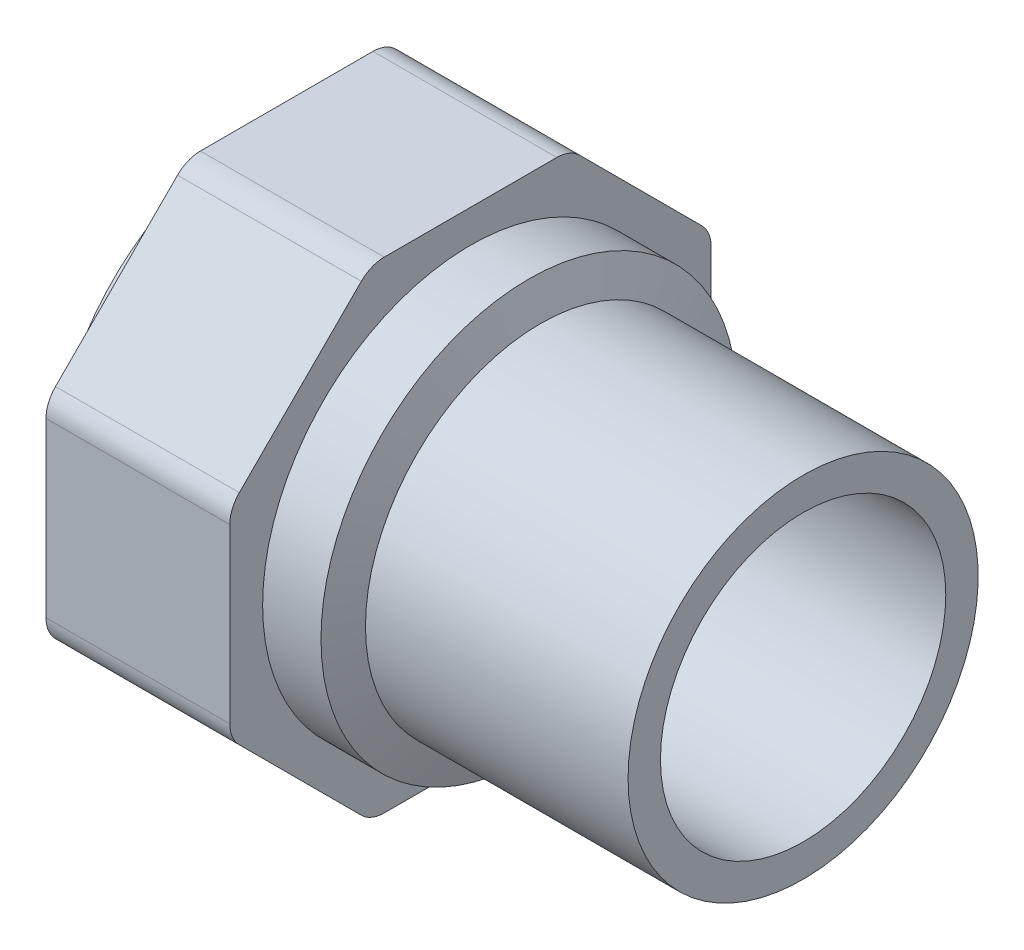
ISO-10303-21;
HEADER;
FILE_DESCRIPTION(('STEP AP214'),'2;1');
FILE_NAME('part.step','',(''),(''),'','','');
FILE_SCHEMA(('AUTOMOTIVE_DESIGN { 1 0 10303 214 1 1 1 1 }'));
ENDSEC;
DATA;
#1=APPLICATION_CONTEXT('core data for automotive mechanical design processes');
#2=APPLICATION_PROTOCOL_DEFINITION('international standard','automotive_design',2000,#1);
#3=PRODUCT_CONTEXT('',#1,'mechanical');
#4=PRODUCT('Part','Part','',(#3));
#5=PRODUCT_RELATED_PRODUCT_CATEGORY('part','',(#4));
#6=PRODUCT_DEFINITION_FORMATION('','',#4);
#7=PRODUCT_DEFINITION_CONTEXT('part definition',#1,'design');
#8=PRODUCT_DEFINITION('design','',#6,#7);
#9=PRODUCT_DEFINITION_SHAPE('','',#8);
#10=(LENGTH_UNIT() NAMED_UNIT(*) SI_UNIT(.MILLI.,.METRE.));
#11=(NAMED_UNIT(*) PLANE_ANGLE_UNIT() SI_UNIT($,.RADIAN.));
#12=(NAMED_UNIT(*) SI_UNIT($,.STERADIAN.) SOLID_ANGLE_UNIT());
#13=UNCERTAINTY_MEASURE_WITH_UNIT(LENGTH_MEASURE(1.E-05),#10,'distance_accuracy_value','');
#14=(GEOMETRIC_REPRESENTATION_CONTEXT(3) GLOBAL_UNCERTAINTY_ASSIGNED_CONTEXT((#13)) GLOBAL_UNIT_ASSIGNED_CONTEXT((#10,
#11,#12)) REPRESENTATION_CONTEXT('',''));
#15=CARTESIAN_POINT('',(0.,0.,0.));
#16=DIRECTION('',(0.,0.,1.));
#17=DIRECTION('',(1.,0.,0.));
#18=AXIS2_PLACEMENT_3D('',#15,#16,#17);
#19=CARTESIAN_POINT('',(-30.,0.,0.));
#20=DIRECTION('',(-1.,0.,0.));
#21=DIRECTION('',(0.,0.,1.));
#22=AXIS2_PLACEMENT_3D('',#19,#20,#21);
#23=CYLINDRICAL_SURFACE('',#22,20.);
#24=CARTESIAN_POINT('',(-30.,0.,0.));
#25=DIRECTION('',(1.,0.,0.));
#26=DIRECTION('',(0.,1.,0.));
#27=AXIS2_PLACEMENT_3D('',#24,#25,#26);
#28=CIRCLE('',#27,20.);
#29=CARTESIAN_POINT('',(-30.,20.,0.));
#30=VERTEX_POINT('',#29);
#31=EDGE_CURVE('E193',#30,#30,#28,.F.);
#32=ORIENTED_EDGE('',*,*,#31,.F.);
#33=EDGE_LOOP('',(#32));
#34=FACE_BOUND('',#33,.T.);
#35=CARTESIAN_POINT('',(0.,0.,0.));
#36=DIRECTION('',(-1.,0.,0.));
#37=DIRECTION('',(0.,0.,1.));
#38=AXIS2_PLACEMENT_3D('',#35,#36,#37);
#39=CIRCLE('',#38,20.);
#40=CARTESIAN_POINT('',(0.,0.,20.));
#41=VERTEX_POINT('',#40);
#42=EDGE_CURVE('E18',#41,#41,#39,.F.);
#43=ORIENTED_EDGE('',*,*,#42,.F.);
#44=EDGE_LOOP('',(#43));
#45=FACE_BOUND('',#44,.T.);
#46=ADVANCED_FACE('F15',(#34,#45),#23,.T.);
#47=CARTESIAN_POINT('',(-30.,0.,0.));
#48=DIRECTION('',(-1.,0.,0.));
#49=DIRECTION('',(0.,0.,1.));
#50=AXIS2_PLACEMENT_3D('',#47,#48,#49);
#51=CONICAL_SURFACE('',#50,20.,1.22918083614709);
#52=CARTESIAN_POINT('',(-31.3333333333333,0.,0.));
#53=DIRECTION('',(-1.,0.,0.));
#54=DIRECTION('',(0.,1.,0.));
#55=AXIS2_PLACEMENT_3D('',#52,#53,#54);
#56=CIRCLE('',#55,23.75);
#57=CARTESIAN_POINT('',(-31.3333333333333,23.75,0.));
#58=VERTEX_POINT('',#57);
#59=EDGE_CURVE('E189',#58,#58,#56,.T.);
#60=ORIENTED_EDGE('',*,*,#59,.F.);
#61=EDGE_LOOP('',(#60));
#62=FACE_BOUND('',#61,.T.);
#63=ORIENTED_EDGE('',*,*,#31,.T.);
#64=EDGE_LOOP('',(#63));
#65=FACE_BOUND('',#64,.T.);
#66=ADVANCED_FACE('F268',(#62,#65),#51,.T.);
#67=CARTESIAN_POINT('',(0.,20.,20.2400021083974));
#68=DIRECTION('',(1.,0.,0.));
#69=DIRECTION('',(0.,-1.,0.));
#70=AXIS2_PLACEMENT_3D('',#67,#68,#69);
#71=PLANE('',#70);
#72=CARTESIAN_POINT('',(0.,0.,0.));
#73=DIRECTION('',(-1.,0.,0.));
#74=DIRECTION('',(0.,0.,1.));
#75=AXIS2_PLACEMENT_3D('',#72,#73,#74);
#76=CIRCLE('',#75,16.3);
#77=CARTESIAN_POINT('',(0.,0.,16.3));
#78=VERTEX_POINT('',#77);
#79=EDGE_CURVE('E192',#78,#78,#76,.F.);
#80=ORIENTED_EDGE('',*,*,#79,.F.);
#81=EDGE_LOOP('',(#80));
#82=FACE_BOUND('',#81,.T.);
#83=ORIENTED_EDGE('',*,*,#42,.T.);
#84=EDGE_LOOP('',(#83));
#85=FACE_BOUND('',#84,.T.);
#86=ADVANCED_FACE('F264',(#82,#85),#71,.T.);
#87=CARTESIAN_POINT('',(-38.,0.,0.));
#88=DIRECTION('',(-1.,0.,0.));
#89=DIRECTION('',(0.,0.,1.));
#90=AXIS2_PLACEMENT_3D('',#87,#88,#89);
#91=CYLINDRICAL_SURFACE('',#90,23.75);
#92=CARTESIAN_POINT('',(-38.,0.,0.));
#93=DIRECTION('',(-1.,0.,0.));
#94=DIRECTION('',(0.,0.,1.));
#95=AXIS2_PLACEMENT_3D('',#92,#93,#94);
#96=CIRCLE('',#95,23.75);
#97=CARTESIAN_POINT('',(-38.,0.,23.75));
#98=VERTEX_POINT('',#97);
#99=EDGE_CURVE('E188',#98,#98,#96,.T.);
#100=ORIENTED_EDGE('',*,*,#99,.F.);
#101=EDGE_LOOP('',(#100));
#102=FACE_BOUND('',#101,.T.);
#103=ORIENTED_EDGE('',*,*,#59,.T.);
#104=EDGE_LOOP('',(#103));
#105=FACE_BOUND('',#104,.T.);
#106=ADVANCED_FACE('F267',(#102,#105),#91,.T.);
#107=CARTESIAN_POINT('',(0.,0.,0.));
#108=DIRECTION('',(-1.,0.,0.));
#109=DIRECTION('',(0.,0.,1.));
#110=AXIS2_PLACEMENT_3D('',#107,#108,#109);
#111=CYLINDRICAL_SURFACE('',#110,16.3);
#112=ORIENTED_EDGE('',*,*,#79,.T.);
#113=EDGE_LOOP('',(#112));
#114=FACE_BOUND('',#113,.T.);
#115=CARTESIAN_POINT('',(-36.8820851410869,0.,0.));
#116=DIRECTION('',(1.,0.,0.));
#117=DIRECTION('',(0.,1.,0.));
#118=AXIS2_PLACEMENT_3D('',#115,#116,#117);
#119=CIRCLE('',#118,16.3);
#120=CARTESIAN_POINT('',(-36.8820851410869,16.3,0.));
#121=VERTEX_POINT('',#120);
#122=EDGE_CURVE('E135',#121,#121,#119,.T.);
#123=ORIENTED_EDGE('',*,*,#122,.F.);
#124=EDGE_LOOP('',(#123));
#125=FACE_BOUND('',#124,.T.);
#126=ADVANCED_FACE('F261',(#114,#125),#111,.F.);
#127=CARTESIAN_POINT('',(-38.,27.5,27.5));
#128=DIRECTION('',(1.,0.,0.));
#129=DIRECTION('',(0.,-1.,0.));
#130=AXIS2_PLACEMENT_3D('',#127,#128,#129);
#131=PLANE('',#130);
#132=ORIENTED_EDGE('',*,*,#99,.T.);
#133=EDGE_LOOP('',(#132));
#134=FACE_BOUND('',#133,.T.);
#135=CARTESIAN_POINT('',(-38.,9.85828278447967,23.8));
#136=DIRECTION('',(1.,0.,0.));
#137=DIRECTION('',(0.,0.,-1.));
#138=AXIS2_PLACEMENT_3D('',#135,#136,#137);
#139=CIRCLE('',#138,3.69999999999999);
#140=CARTESIAN_POINT('',(-38.,9.85828278447966,27.5));
#141=VERTEX_POINT('',#140);
#142=CARTESIAN_POINT('',(-38.,12.4745778748699,26.4162950903902));
#143=VERTEX_POINT('',#142);
#144=EDGE_CURVE('E254',#141,#143,#139,.F.);
#145=ORIENTED_EDGE('',*,*,#144,.F.);
#146=DIRECTION('',(0.,1.,0.));
#147=VECTOR('',#146,1.);
#148=CARTESIAN_POINT('',(-38.,0.,27.5));
#149=LINE('',#148,#147);
#150=CARTESIAN_POINT('',(-38.,-9.85828278447966,27.5));
#151=VERTEX_POINT('',#150);
#152=EDGE_CURVE('E132',#151,#141,#149,.T.);
#153=ORIENTED_EDGE('',*,*,#152,.F.);
#154=CARTESIAN_POINT('',(-38.,-9.85828278447967,23.8));
#155=DIRECTION('',(1.,0.,0.));
#156=DIRECTION('',(0.,0.,-1.));
#157=AXIS2_PLACEMENT_3D('',#154,#155,#156);
#158=CIRCLE('',#157,3.69999999999997);
#159=CARTESIAN_POINT('',(-38.,-12.4745778748699,26.4162950903902));
#160=VERTEX_POINT('',#159);
#161=EDGE_CURVE('E126',#160,#151,#158,.F.);
#162=ORIENTED_EDGE('',*,*,#161,.F.);
#163=DIRECTION('',(0.,0.707106781186548,0.707106781186548));
#164=VECTOR('',#163,1.);
#165=CARTESIAN_POINT('',(-38.,-19.4454364826301,19.4454364826301));
#166=LINE('',#165,#164);
#167=CARTESIAN_POINT('',(-38.,-26.4162950903902,12.4745778748699));
#168=VERTEX_POINT('',#167);
#169=EDGE_CURVE('E130',#168,#160,#166,.T.);
#170=ORIENTED_EDGE('',*,*,#169,.F.);
#171=CARTESIAN_POINT('',(-38.,-23.8,9.85828278447966));
#172=DIRECTION('',(1.,0.,0.));
#173=DIRECTION('',(0.,0.,-1.));
#174=AXIS2_PLACEMENT_3D('',#171,#172,#173);
#175=CIRCLE('',#174,3.69999999999998);
#176=CARTESIAN_POINT('',(-38.,-27.5,9.85828278447965));
#177=VERTEX_POINT('',#176);
#178=EDGE_CURVE('E149',#177,#168,#175,.F.);
#179=ORIENTED_EDGE('',*,*,#178,.F.);
#180=DIRECTION('',(0.,0.,1.));
#181=VECTOR('',#180,1.);
#182=CARTESIAN_POINT('',(-38.,-27.5,0.));
#183=LINE('',#182,#181);
#184=CARTESIAN_POINT('',(-38.,-27.5,-9.85828278447969));
#185=VERTEX_POINT('',#184);
#186=EDGE_CURVE('E154',#185,#177,#183,.T.);
#187=ORIENTED_EDGE('',*,*,#186,.F.);
#188=CARTESIAN_POINT('',(-38.,-23.8,-9.85828278447969));
#189=DIRECTION('',(1.,0.,0.));
#190=DIRECTION('',(0.,0.,-1.));
#191=AXIS2_PLACEMENT_3D('',#188,#189,#190);
#192=CIRCLE('',#191,3.69999999999996);
#193=CARTESIAN_POINT('',(-38.,-26.4162950903902,-12.4745778748699));
#194=VERTEX_POINT('',#193);
#195=EDGE_CURVE('E239',#194,#185,#192,.F.);
#196=ORIENTED_EDGE('',*,*,#195,.F.);
#197=DIRECTION('',(0.,-0.707106781186548,0.707106781186547));
#198=VECTOR('',#197,1.);
#199=CARTESIAN_POINT('',(-38.,-19.44543648263,-19.4454364826301));
#200=LINE('',#199,#198);
#201=CARTESIAN_POINT('',(-38.,-12.4745778748699,-26.4162950903902));
#202=VERTEX_POINT('',#201);
#203=EDGE_CURVE('E159',#202,#194,#200,.T.);
#204=ORIENTED_EDGE('',*,*,#203,.F.);
#205=CARTESIAN_POINT('',(-38.,-9.85828278447965,-23.8));
#206=DIRECTION('',(1.,0.,0.));
#207=DIRECTION('',(0.,0.,-1.));
#208=AXIS2_PLACEMENT_3D('',#205,#206,#207);
#209=CIRCLE('',#208,3.70000000000001);
#210=CARTESIAN_POINT('',(-38.,-9.85828278447965,-27.5));
#211=VERTEX_POINT('',#210);
#212=EDGE_CURVE('E242',#211,#202,#209,.F.);
#213=ORIENTED_EDGE('',*,*,#212,.F.);
#214=DIRECTION('',(0.,-1.,0.));
#215=VECTOR('',#214,1.);
#216=CARTESIAN_POINT('',(-38.,0.,-27.5));
#217=LINE('',#216,#215);
#218=CARTESIAN_POINT('',(-38.,9.85828278447969,-27.5));
#219=VERTEX_POINT('',#218);
#220=EDGE_CURVE('E164',#219,#211,#217,.T.);
#221=ORIENTED_EDGE('',*,*,#220,.F.);
#222=CARTESIAN_POINT('',(-38.,9.85828278447969,-23.8));
#223=DIRECTION('',(1.,0.,0.));
#224=DIRECTION('',(0.,0.,-1.));
#225=AXIS2_PLACEMENT_3D('',#222,#223,#224);
#226=CIRCLE('',#225,3.69999999999999);
#227=CARTESIAN_POINT('',(-38.,12.4745778748699,-26.4162950903902));
#228=VERTEX_POINT('',#227);
#229=EDGE_CURVE('E245',#228,#219,#226,.F.);
#230=ORIENTED_EDGE('',*,*,#229,.F.);
#231=DIRECTION('',(0.,-0.707106781186547,-0.707106781186548));
#232=VECTOR('',#231,1.);
#233=CARTESIAN_POINT('',(-38.,19.4454364826301,-19.4454364826301));
#234=LINE('',#233,#232);
#235=CARTESIAN_POINT('',(-38.,26.4162950903902,-12.4745778748699));
#236=VERTEX_POINT('',#235);
#237=EDGE_CURVE('E169',#236,#228,#234,.T.);
#238=ORIENTED_EDGE('',*,*,#237,.F.);
#239=CARTESIAN_POINT('',(-38.,23.8,-9.85828278447965));
#240=DIRECTION('',(1.,0.,0.));
#241=DIRECTION('',(0.,0.,-1.));
#242=AXIS2_PLACEMENT_3D('',#239,#240,#241);
#243=CIRCLE('',#242,3.70000000000001);
#244=CARTESIAN_POINT('',(-38.,27.5,-9.85828278447965));
#245=VERTEX_POINT('',#244);
#246=EDGE_CURVE('E248',#245,#236,#243,.F.);
#247=ORIENTED_EDGE('',*,*,#246,.F.);
#248=DIRECTION('',(0.,0.,-1.));
#249=VECTOR('',#248,1.);
#250=CARTESIAN_POINT('',(-38.,27.5,0.));
#251=LINE('',#250,#249);
#252=CARTESIAN_POINT('',(-38.,27.5,9.85828278447967));
#253=VERTEX_POINT('',#252);
#254=EDGE_CURVE('E174',#253,#245,#251,.T.);
#255=ORIENTED_EDGE('',*,*,#254,.F.);
#256=CARTESIAN_POINT('',(-38.,23.8,9.85828278447967));
#257=DIRECTION('',(1.,0.,0.));
#258=DIRECTION('',(0.,0.,-1.));
#259=AXIS2_PLACEMENT_3D('',#256,#257,#258);
#260=CIRCLE('',#259,3.69999999999997);
#261=CARTESIAN_POINT('',(-38.,26.4162950903902,12.4745778748699));
#262=VERTEX_POINT('',#261);
#263=EDGE_CURVE('E251',#262,#253,#260,.F.);
#264=ORIENTED_EDGE('',*,*,#263,.F.);
#265=DIRECTION('',(0.,0.707106781186548,-0.707106781186548));
#266=VECTOR('',#265,1.);
#267=CARTESIAN_POINT('',(-38.,19.4454364826301,19.4454364826301));
#268=LINE('',#267,#266);
#269=EDGE_CURVE('E179',#143,#262,#268,.T.);
#270=ORIENTED_EDGE('',*,*,#269,.F.);
#271=EDGE_LOOP('',(#145,#153,#162,#170,#179,#187,#196,#204,#213,#221,#230,#238,#247,#255,#264,#270));
#272=FACE_BOUND('',#271,.T.);
#273=ADVANCED_FACE('F128',(#134,#272),#131,.T.);
#274=CARTESIAN_POINT('',(-38.,0.,0.));
#275=DIRECTION('',(-1.,0.,0.));
#276=DIRECTION('',(0.,0.,1.));
#277=AXIS2_PLACEMENT_3D('',#274,#275,#276);
#278=CONICAL_SURFACE('',#277,18.2362853341737,1.0471975511966);
#279=ORIENTED_EDGE('',*,*,#122,.T.);
#280=EDGE_LOOP('',(#279));
#281=FACE_BOUND('',#280,.T.);
#282=CARTESIAN_POINT('',(-38.,0.,0.));
#283=DIRECTION('',(1.,0.,0.));
#284=DIRECTION('',(0.,1.,0.));
#285=AXIS2_PLACEMENT_3D('',#282,#283,#284);
#286=CIRCLE('',#285,18.2362853341737);
#287=CARTESIAN_POINT('',(-38.,18.2362853341737,0.));
#288=VERTEX_POINT('',#287);
#289=EDGE_CURVE('E153',#288,#288,#286,.T.);
#290=ORIENTED_EDGE('',*,*,#289,.F.);
#291=EDGE_LOOP('',(#290));
#292=FACE_BOUND('',#291,.T.);
#293=ADVANCED_FACE('F438',(#281,#292),#278,.F.);
#294=CARTESIAN_POINT('',(-38.,-9.85828278447967,23.8));
#295=DIRECTION('',(1.,0.,0.));
#296=DIRECTION('',(0.,0.,-1.));
#297=AXIS2_PLACEMENT_3D('',#294,#295,#296);
#298=CYLINDRICAL_SURFACE('',#297,3.69999999999997);
#299=CARTESIAN_POINT('',(-59.,-9.85828278447967,23.8));
#300=DIRECTION('',(1.,0.,0.));
#301=DIRECTION('',(0.,0.,-1.));
#302=AXIS2_PLACEMENT_3D('',#299,#300,#301);
#303=CIRCLE('',#302,3.69999999999997);
#304=CARTESIAN_POINT('',(-59.,-12.4745778748699,26.4162950903902));
#305=VERTEX_POINT('',#304);
#306=CARTESIAN_POINT('',(-59.,-9.85828278447966,27.5));
#307=VERTEX_POINT('',#306);
#308=EDGE_CURVE('E141',#305,#307,#303,.F.);
#309=ORIENTED_EDGE('',*,*,#308,.F.);
#310=DIRECTION('',(1.,0.,0.));
#311=VECTOR('',#310,1.);
#312=CARTESIAN_POINT('',(-59.,-12.4745778748699,26.4162950903902));
#313=LINE('',#312,#311);
#314=EDGE_CURVE('E138',#160,#305,#313,.F.);
#315=ORIENTED_EDGE('',*,*,#314,.F.);
#316=ORIENTED_EDGE('',*,*,#161,.T.);
#317=DIRECTION('',(1.,0.,0.));
#318=VECTOR('',#317,1.);
#319=CARTESIAN_POINT('',(-59.,-9.85828278447966,27.5));
#320=LINE('',#319,#318);
#321=EDGE_CURVE('E185',#307,#151,#320,.T.);
#322=ORIENTED_EDGE('',*,*,#321,.F.);
#323=EDGE_LOOP('',(#309,#315,#316,#322));
#324=FACE_BOUND('',#323,.T.);
#325=ADVANCED_FACE('F139',(#324),#298,.T.);
#326=CARTESIAN_POINT('',(-59.,9.85828278447966,27.5));
#327=DIRECTION('',(0.,0.,1.));
#328=DIRECTION('',(0.,-1.,0.));
#329=AXIS2_PLACEMENT_3D('',#326,#327,#328);
#330=PLANE('',#329);
#331=DIRECTION('',(0.,1.,0.));
#332=VECTOR('',#331,1.);
#333=CARTESIAN_POINT('',(-59.,0.,27.5));
#334=LINE('',#333,#332);
#335=CARTESIAN_POINT('',(-59.,9.85828278447966,27.5));
#336=VERTEX_POINT('',#335);
#337=EDGE_CURVE('E236',#307,#336,#334,.T.);
#338=ORIENTED_EDGE('',*,*,#337,.F.);
#339=ORIENTED_EDGE('',*,*,#321,.T.);
#340=ORIENTED_EDGE('',*,*,#152,.T.);
#341=DIRECTION('',(1.,0.,0.));
#342=VECTOR('',#341,1.);
#343=CARTESIAN_POINT('',(-48.5,9.85828278447966,27.5));
#344=LINE('',#343,#342);
#345=EDGE_CURVE('E183',#336,#141,#344,.T.);
#346=ORIENTED_EDGE('',*,*,#345,.F.);
#347=EDGE_LOOP('',(#338,#339,#340,#346));
#348=FACE_BOUND('',#347,.T.);
#349=ADVANCED_FACE('F387',(#348),#330,.T.);
#350=CARTESIAN_POINT('',(-38.,9.85828278447967,23.8));
#351=DIRECTION('',(1.,0.,0.));
#352=DIRECTION('',(0.,0.,-1.));
#353=AXIS2_PLACEMENT_3D('',#350,#351,#352);
#354=CYLINDRICAL_SURFACE('',#353,3.69999999999999);
#355=CARTESIAN_POINT('',(-59.,9.85828278447967,23.8));
#356=DIRECTION('',(1.,0.,0.));
#357=DIRECTION('',(0.,0.,-1.));
#358=AXIS2_PLACEMENT_3D('',#355,#356,#357);
#359=CIRCLE('',#358,3.69999999999999);
#360=CARTESIAN_POINT('',(-59.,12.4745778748699,26.4162950903902));
#361=VERTEX_POINT('',#360);
#362=EDGE_CURVE('E233',#336,#361,#359,.F.);
#363=ORIENTED_EDGE('',*,*,#362,.F.);
#364=ORIENTED_EDGE('',*,*,#345,.T.);
#365=ORIENTED_EDGE('',*,*,#144,.T.);
#366=DIRECTION('',(1.,0.,0.));
#367=VECTOR('',#366,1.);
#368=CARTESIAN_POINT('',(-59.,12.4745778748699,26.4162950903902));
#369=LINE('',#368,#367);
#370=EDGE_CURVE('E182',#361,#143,#369,.T.);
#371=ORIENTED_EDGE('',*,*,#370,.F.);
#372=EDGE_LOOP('',(#363,#364,#365,#371));
#373=FACE_BOUND('',#372,.T.);
#374=ADVANCED_FACE('F425',(#373),#354,.T.);
#375=CARTESIAN_POINT('',(-59.,26.4162950903902,12.4745778748699));
#376=DIRECTION('',(0.,0.707106781186547,0.707106781186547));
#377=DIRECTION('',(0.,-0.707106781186547,0.707106781186547));
#378=AXIS2_PLACEMENT_3D('',#375,#376,#377);
#379=PLANE('',#378);
#380=CARTESIAN_POINT('',(-59.,12.4745778748699,26.4162950903902));
#381=CARTESIAN_POINT('',(-59.,13.0554827588499,25.8353902064102));
#382=CARTESIAN_POINT('',(-59.,13.6363876428299,25.2544853224302));
#383=CARTESIAN_POINT('',(-59.,14.7981974107899,24.0926755544702));
#384=CARTESIAN_POINT('',(-59.,15.37910229477,23.5117706704902));
#385=CARTESIAN_POINT('',(-59.,16.54091206273,22.3499609025301));
#386=CARTESIAN_POINT('',(-59.,17.12181694671,21.7690560185501));
#387=CARTESIAN_POINT('',(-59.,18.28362671467,20.6072462505901));
#388=CARTESIAN_POINT('',(-59.,18.86453159865,20.0263413666101));
#389=CARTESIAN_POINT('',(-59.,20.0263413666101,18.86453159865));
#390=CARTESIAN_POINT('',(-59.,20.6072462505901,18.28362671467));
#391=CARTESIAN_POINT('',(-59.,21.7690560185501,17.12181694671));
#392=CARTESIAN_POINT('',(-59.,22.3499609025301,16.54091206273));
#393=CARTESIAN_POINT('',(-59.,23.5117706704902,15.37910229477));
#394=CARTESIAN_POINT('',(-59.,24.0926755544702,14.7981974107899));
#395=CARTESIAN_POINT('',(-59.,25.2544853224302,13.6363876428299));
#396=CARTESIAN_POINT('',(-59.,25.8353902064102,13.0554827588499));
#397=CARTESIAN_POINT('',(-59.,26.4162950903902,12.4745778748699));
#398=B_SPLINE_CURVE_WITH_KNOTS('',3,(#380,#381,#382,#383,#384,#385,#386,#387,#388,#389,#390,
#391,#392,#393,#394,#395,#396,#397),.UNSPECIFIED.,.F.,.F.,(4,2,2,2,2,2,2,2,4),(0.,
2.46457069611991,4.92914139223983,7.39371208835974,9.85828278447966,12.3228534805996,
14.7874241767195,17.2519948728394,19.7165655689593),.UNSPECIFIED.);
#399=CARTESIAN_POINT('',(-59.,26.4162950903902,12.4745778748699));
#400=VERTEX_POINT('',#399);
#401=EDGE_CURVE('E232',#361,#400,#398,.T.);
#402=ORIENTED_EDGE('',*,*,#401,.F.);
#403=ORIENTED_EDGE('',*,*,#370,.T.);
#404=ORIENTED_EDGE('',*,*,#269,.T.);
#405=DIRECTION('',(1.,0.,0.));
#406=VECTOR('',#405,1.);
#407=CARTESIAN_POINT('',(-48.5,26.4162950903902,12.4745778748699));
#408=LINE('',#407,#406);
#409=EDGE_CURVE('E178',#400,#262,#408,.T.);
#410=ORIENTED_EDGE('',*,*,#409,.F.);
#411=EDGE_LOOP('',(#402,#403,#404,#410));
#412=FACE_BOUND('',#411,.T.);
#413=ADVANCED_FACE('F423',(#412),#379,.T.);
#414=CARTESIAN_POINT('',(-38.,23.8,9.85828278447967));
#415=DIRECTION('',(1.,0.,0.));
#416=DIRECTION('',(0.,0.,-1.));
#417=AXIS2_PLACEMENT_3D('',#414,#415,#416);
#418=CYLINDRICAL_SURFACE('',#417,3.69999999999997);
#419=CARTESIAN_POINT('',(-59.,23.8,9.85828278447967));
#420=DIRECTION('',(1.,0.,0.));
#421=DIRECTION('',(0.,0.,-1.));
#422=AXIS2_PLACEMENT_3D('',#419,#420,#421);
#423=CIRCLE('',#422,3.69999999999997);
#424=CARTESIAN_POINT('',(-59.,27.5,9.85828278447967));
#425=VERTEX_POINT('',#424);
#426=EDGE_CURVE('E229',#400,#425,#423,.F.);
#427=ORIENTED_EDGE('',*,*,#426,.F.);
#428=ORIENTED_EDGE('',*,*,#409,.T.);
#429=ORIENTED_EDGE('',*,*,#263,.T.);
#430=DIRECTION('',(1.,0.,0.));
#431=VECTOR('',#430,1.);
#432=CARTESIAN_POINT('',(-59.,27.5,9.85828278447967));
#433=LINE('',#432,#431);
#434=EDGE_CURVE('E177',#425,#253,#433,.T.);
#435=ORIENTED_EDGE('',*,*,#434,.F.);
#436=EDGE_LOOP('',(#427,#428,#429,#435));
#437=FACE_BOUND('',#436,.T.);
#438=ADVANCED_FACE('F420',(#437),#418,.T.);
#439=CARTESIAN_POINT('',(-59.,27.5,-9.85828278447965));
#440=DIRECTION('',(0.,1.,0.));
#441=DIRECTION('',(0.,0.,1.));
#442=AXIS2_PLACEMENT_3D('',#439,#440,#441);
#443=PLANE('',#442);
#444=DIRECTION('',(0.,0.,-1.));
#445=VECTOR('',#444,1.);
#446=CARTESIAN_POINT('',(-59.,27.5,27.5));
#447=LINE('',#446,#445);
#448=CARTESIAN_POINT('',(-59.,27.5,-9.85828278447965));
#449=VERTEX_POINT('',#448);
#450=EDGE_CURVE('E228',#425,#449,#447,.T.);
#451=ORIENTED_EDGE('',*,*,#450,.F.);
#452=ORIENTED_EDGE('',*,*,#434,.T.);
#453=ORIENTED_EDGE('',*,*,#254,.T.);
#454=DIRECTION('',(1.,0.,0.));
#455=VECTOR('',#454,1.);
#456=CARTESIAN_POINT('',(-48.5,27.5,-9.85828278447965));
#457=LINE('',#456,#455);
#458=EDGE_CURVE('E173',#449,#245,#457,.T.);
#459=ORIENTED_EDGE('',*,*,#458,.F.);
#460=EDGE_LOOP('',(#451,#452,#453,#459));
#461=FACE_BOUND('',#460,.T.);
#462=ADVANCED_FACE('F417',(#461),#443,.T.);
#463=CARTESIAN_POINT('',(-38.,23.8,-9.85828278447965));
#464=DIRECTION('',(1.,0.,0.));
#465=DIRECTION('',(0.,0.,-1.));
#466=AXIS2_PLACEMENT_3D('',#463,#464,#465);
#467=CYLINDRICAL_SURFACE('',#466,3.70000000000001);
#468=CARTESIAN_POINT('',(-59.,23.8,-9.85828278447965));
#469=DIRECTION('',(1.,0.,0.));
#470=DIRECTION('',(0.,0.,-1.));
#471=AXIS2_PLACEMENT_3D('',#468,#469,#470);
#472=CIRCLE('',#471,3.70000000000001);
#473=CARTESIAN_POINT('',(-59.,26.4162950903902,-12.4745778748699));
#474=VERTEX_POINT('',#473);
#475=EDGE_CURVE('E225',#449,#474,#472,.F.);
#476=ORIENTED_EDGE('',*,*,#475,.F.);
#477=ORIENTED_EDGE('',*,*,#458,.T.);
#478=ORIENTED_EDGE('',*,*,#246,.T.);
#479=DIRECTION('',(1.,0.,0.));
#480=VECTOR('',#479,1.);
#481=CARTESIAN_POINT('',(-59.,26.4162950903902,-12.4745778748699));
#482=LINE('',#481,#480);
#483=EDGE_CURVE('E172',#474,#236,#482,.T.);
#484=ORIENTED_EDGE('',*,*,#483,.F.);
#485=EDGE_LOOP('',(#476,#477,#478,#484));
#486=FACE_BOUND('',#485,.T.);
#487=ADVANCED_FACE('F414',(#486),#467,.T.);
#488=CARTESIAN_POINT('',(-59.,12.4745778748699,-26.4162950903902));
#489=DIRECTION('',(0.,0.707106781186548,-0.707106781186547));
#490=DIRECTION('',(0.,0.707106781186547,0.707106781186548));
#491=AXIS2_PLACEMENT_3D('',#488,#489,#490);
#492=PLANE('',#491);
#493=CARTESIAN_POINT('',(-59.,26.4162950903902,-12.4745778748699));
#494=CARTESIAN_POINT('',(-59.,25.8353902064102,-13.0554827588499));
#495=CARTESIAN_POINT('',(-59.,25.2544853224302,-13.6363876428299));
#496=CARTESIAN_POINT('',(-59.,24.0926755544702,-14.7981974107899));
#497=CARTESIAN_POINT('',(-59.,23.5117706704902,-15.37910229477));
#498=CARTESIAN_POINT('',(-59.,22.3499609025301,-16.54091206273));
#499=CARTESIAN_POINT('',(-59.,21.7690560185501,-17.12181694671));
#500=CARTESIAN_POINT('',(-59.,20.6072462505901,-18.28362671467));
#501=CARTESIAN_POINT('',(-59.,20.0263413666101,-18.86453159865));
#502=CARTESIAN_POINT('',(-59.,18.8645315986501,-20.0263413666101));
#503=CARTESIAN_POINT('',(-59.,18.28362671467,-20.6072462505901));
#504=CARTESIAN_POINT('',(-59.,17.12181694671,-21.7690560185501));
#505=CARTESIAN_POINT('',(-59.,16.54091206273,-22.3499609025301));
#506=CARTESIAN_POINT('',(-59.,15.37910229477,-23.5117706704902));
#507=CARTESIAN_POINT('',(-59.,14.79819741079,-24.0926755544702));
#508=CARTESIAN_POINT('',(-59.,13.6363876428299,-25.2544853224302));
#509=CARTESIAN_POINT('',(-59.,13.0554827588499,-25.8353902064102));
#510=CARTESIAN_POINT('',(-59.,12.4745778748699,-26.4162950903902));
#511=B_SPLINE_CURVE_WITH_KNOTS('',3,(#493,#494,#495,#496,#497,#498,#499,#500,#501,#502,#503,
#504,#505,#506,#507,#508,#509,#510),.UNSPECIFIED.,.F.,.F.,(4,2,2,2,2,2,2,2,4),(0.,
2.46457069611992,4.92914139223983,7.39371208835975,9.85828278447966,12.3228534805996,
14.7874241767195,17.2519948728394,19.7165655689593),.UNSPECIFIED.);
#512=CARTESIAN_POINT('',(-59.,12.4745778748699,-26.4162950903902));
#513=VERTEX_POINT('',#512);
#514=EDGE_CURVE('E224',#474,#513,#511,.T.);
#515=ORIENTED_EDGE('',*,*,#514,.F.);
#516=ORIENTED_EDGE('',*,*,#483,.T.);
#517=ORIENTED_EDGE('',*,*,#237,.T.);
#518=DIRECTION('',(1.,0.,0.));
#519=VECTOR('',#518,1.);
#520=CARTESIAN_POINT('',(-48.5,12.4745778748699,-26.4162950903902));
#521=LINE('',#520,#519);
#522=EDGE_CURVE('E168',#513,#228,#521,.T.);
#523=ORIENTED_EDGE('',*,*,#522,.F.);
#524=EDGE_LOOP('',(#515,#516,#517,#523));
#525=FACE_BOUND('',#524,.T.);
#526=ADVANCED_FACE('F411',(#525),#492,.T.);
#527=CARTESIAN_POINT('',(-38.,9.85828278447969,-23.8));
#528=DIRECTION('',(1.,0.,0.));
#529=DIRECTION('',(0.,0.,-1.));
#530=AXIS2_PLACEMENT_3D('',#527,#528,#529);
#531=CYLINDRICAL_SURFACE('',#530,3.69999999999999);
#532=CARTESIAN_POINT('',(-59.,9.85828278447969,-23.8));
#533=DIRECTION('',(1.,0.,0.));
#534=DIRECTION('',(0.,0.,-1.));
#535=AXIS2_PLACEMENT_3D('',#532,#533,#534);
#536=CIRCLE('',#535,3.69999999999999);
#537=CARTESIAN_POINT('',(-59.,9.85828278447969,-27.5));
#538=VERTEX_POINT('',#537);
#539=EDGE_CURVE('E221',#513,#538,#536,.F.);
#540=ORIENTED_EDGE('',*,*,#539,.F.);
#541=ORIENTED_EDGE('',*,*,#522,.T.);
#542=ORIENTED_EDGE('',*,*,#229,.T.);
#543=DIRECTION('',(1.,0.,0.));
#544=VECTOR('',#543,1.);
#545=CARTESIAN_POINT('',(-59.,9.85828278447968,-27.5));
#546=LINE('',#545,#544);
#547=EDGE_CURVE('E167',#538,#219,#546,.T.);
#548=ORIENTED_EDGE('',*,*,#547,.F.);
#549=EDGE_LOOP('',(#540,#541,#542,#548));
#550=FACE_BOUND('',#549,.T.);
#551=ADVANCED_FACE('F408',(#550),#531,.T.);
#552=CARTESIAN_POINT('',(-59.,-9.85828278447965,-27.5));
#553=DIRECTION('',(0.,0.,-1.));
#554=DIRECTION('',(0.,1.,0.));
#555=AXIS2_PLACEMENT_3D('',#552,#553,#554);
#556=PLANE('',#555);
#557=DIRECTION('',(0.,-1.,0.));
#558=VECTOR('',#557,1.);
#559=CARTESIAN_POINT('',(-59.,0.,-27.5));
#560=LINE('',#559,#558);
#561=CARTESIAN_POINT('',(-59.,-9.85828278447965,-27.5));
#562=VERTEX_POINT('',#561);
#563=EDGE_CURVE('E220',#538,#562,#560,.T.);
#564=ORIENTED_EDGE('',*,*,#563,.F.);
#565=ORIENTED_EDGE('',*,*,#547,.T.);
#566=ORIENTED_EDGE('',*,*,#220,.T.);
#567=DIRECTION('',(1.,0.,0.));
#568=VECTOR('',#567,1.);
#569=CARTESIAN_POINT('',(-48.5,-9.85828278447965,-27.5));
#570=LINE('',#569,#568);
#571=EDGE_CURVE('E163',#562,#211,#570,.T.);
#572=ORIENTED_EDGE('',*,*,#571,.F.);
#573=EDGE_LOOP('',(#564,#565,#566,#572));
#574=FACE_BOUND('',#573,.T.);
#575=ADVANCED_FACE('F405',(#574),#556,.T.);
#576=CARTESIAN_POINT('',(-38.,-9.85828278447965,-23.8));
#577=DIRECTION('',(1.,0.,0.));
#578=DIRECTION('',(0.,0.,-1.));
#579=AXIS2_PLACEMENT_3D('',#576,#577,#578);
#580=CYLINDRICAL_SURFACE('',#579,3.70000000000001);
#581=CARTESIAN_POINT('',(-59.,-9.85828278447965,-23.8));
#582=DIRECTION('',(1.,0.,0.));
#583=DIRECTION('',(0.,0.,-1.));
#584=AXIS2_PLACEMENT_3D('',#581,#582,#583);
#585=CIRCLE('',#584,3.70000000000001);
#586=CARTESIAN_POINT('',(-59.,-12.4745778748699,-26.4162950903902));
#587=VERTEX_POINT('',#586);
#588=EDGE_CURVE('E217',#562,#587,#585,.F.);
#589=ORIENTED_EDGE('',*,*,#588,.F.);
#590=ORIENTED_EDGE('',*,*,#571,.T.);
#591=ORIENTED_EDGE('',*,*,#212,.T.);
#592=DIRECTION('',(1.,0.,0.));
#593=VECTOR('',#592,1.);
#594=CARTESIAN_POINT('',(-59.,-12.4745778748699,-26.4162950903902));
#595=LINE('',#594,#593);
#596=EDGE_CURVE('E162',#587,#202,#595,.T.);
#597=ORIENTED_EDGE('',*,*,#596,.F.);
#598=EDGE_LOOP('',(#589,#590,#591,#597));
#599=FACE_BOUND('',#598,.T.);
#600=ADVANCED_FACE('F402',(#599),#580,.T.);
#601=CARTESIAN_POINT('',(-59.,-26.4162950903902,-12.4745778748699));
#602=DIRECTION('',(0.,-0.707106781186547,-0.707106781186548));
#603=DIRECTION('',(0.,0.707106781186548,-0.707106781186547));
#604=AXIS2_PLACEMENT_3D('',#601,#602,#603);
#605=PLANE('',#604);
#606=CARTESIAN_POINT('',(-59.,-12.4745778748699,-26.4162950903902));
#607=CARTESIAN_POINT('',(-59.,-13.0554827588499,-25.8353902064102));
#608=CARTESIAN_POINT('',(-59.,-13.6363876428299,-25.2544853224302));
#609=CARTESIAN_POINT('',(-59.,-14.7981974107899,-24.0926755544702));
#610=CARTESIAN_POINT('',(-59.,-15.3791022947699,-23.5117706704902));
#611=CARTESIAN_POINT('',(-59.,-16.54091206273,-22.3499609025301));
#612=CARTESIAN_POINT('',(-59.,-17.12181694671,-21.7690560185501));
#613=CARTESIAN_POINT('',(-59.,-18.28362671467,-20.6072462505901));
#614=CARTESIAN_POINT('',(-59.,-18.86453159865,-20.0263413666101));
#615=CARTESIAN_POINT('',(-59.,-20.0263413666101,-18.8645315986501));
#616=CARTESIAN_POINT('',(-59.,-20.6072462505901,-18.28362671467));
#617=CARTESIAN_POINT('',(-59.,-21.7690560185501,-17.12181694671));
#618=CARTESIAN_POINT('',(-59.,-22.3499609025301,-16.54091206273));
#619=CARTESIAN_POINT('',(-59.,-23.5117706704902,-15.37910229477));
#620=CARTESIAN_POINT('',(-59.,-24.0926755544702,-14.79819741079));
#621=CARTESIAN_POINT('',(-59.,-25.2544853224302,-13.6363876428299));
#622=CARTESIAN_POINT('',(-59.,-25.8353902064102,-13.0554827588499));
#623=CARTESIAN_POINT('',(-59.,-26.4162950903902,-12.4745778748699));
#624=B_SPLINE_CURVE_WITH_KNOTS('',3,(#606,#607,#608,#609,#610,#611,#612,#613,#614,#615,#616,
#617,#618,#619,#620,#621,#622,#623),.UNSPECIFIED.,.F.,.F.,(4,2,2,2,2,2,2,2,4),(0.,
2.46457069611992,4.92914139223984,7.39371208835975,9.85828278447966,12.3228534805996,
14.7874241767195,17.2519948728394,19.7165655689593),.UNSPECIFIED.);
#625=CARTESIAN_POINT('',(-59.,-26.4162950903902,-12.4745778748699));
#626=VERTEX_POINT('',#625);
#627=EDGE_CURVE('E216',#587,#626,#624,.T.);
#628=ORIENTED_EDGE('',*,*,#627,.F.);
#629=ORIENTED_EDGE('',*,*,#596,.T.);
#630=ORIENTED_EDGE('',*,*,#203,.T.);
#631=DIRECTION('',(1.,0.,0.));
#632=VECTOR('',#631,1.);
#633=CARTESIAN_POINT('',(-48.5,-26.4162950903902,-12.4745778748699));
#634=LINE('',#633,#632);
#635=EDGE_CURVE('E158',#626,#194,#634,.T.);
#636=ORIENTED_EDGE('',*,*,#635,.F.);
#637=EDGE_LOOP('',(#628,#629,#630,#636));
#638=FACE_BOUND('',#637,.T.);
#639=ADVANCED_FACE('F399',(#638),#605,.T.);
#640=CARTESIAN_POINT('',(-38.,-23.8,-9.85828278447969));
#641=DIRECTION('',(1.,0.,0.));
#642=DIRECTION('',(0.,0.,-1.));
#643=AXIS2_PLACEMENT_3D('',#640,#641,#642);
#644=CYLINDRICAL_SURFACE('',#643,3.69999999999996);
#645=CARTESIAN_POINT('',(-59.,-23.8,-9.85828278447969));
#646=DIRECTION('',(1.,0.,0.));
#647=DIRECTION('',(0.,0.,-1.));
#648=AXIS2_PLACEMENT_3D('',#645,#646,#647);
#649=CIRCLE('',#648,3.69999999999996);
#650=CARTESIAN_POINT('',(-59.,-27.5,-9.85828278447969));
#651=VERTEX_POINT('',#650);
#652=EDGE_CURVE('E213',#626,#651,#649,.F.);
#653=ORIENTED_EDGE('',*,*,#652,.F.);
#654=ORIENTED_EDGE('',*,*,#635,.T.);
#655=ORIENTED_EDGE('',*,*,#195,.T.);
#656=DIRECTION('',(1.,0.,0.));
#657=VECTOR('',#656,1.);
#658=CARTESIAN_POINT('',(-59.,-27.5,-9.85828278447968));
#659=LINE('',#658,#657);
#660=EDGE_CURVE('E157',#651,#185,#659,.T.);
#661=ORIENTED_EDGE('',*,*,#660,.F.);
#662=EDGE_LOOP('',(#653,#654,#655,#661));
#663=FACE_BOUND('',#662,.T.);
#664=ADVANCED_FACE('F396',(#663),#644,.T.);
#665=CARTESIAN_POINT('',(-59.,-27.5,9.85828278447965));
#666=DIRECTION('',(0.,-1.,0.));
#667=DIRECTION('',(0.,0.,-1.));
#668=AXIS2_PLACEMENT_3D('',#665,#666,#667);
#669=PLANE('',#668);
#670=DIRECTION('',(0.,0.,-1.));
#671=VECTOR('',#670,1.);
#672=CARTESIAN_POINT('',(-59.,-27.5,27.5));
#673=LINE('',#672,#671);
#674=CARTESIAN_POINT('',(-59.,-27.5,9.85828278447965));
#675=VERTEX_POINT('',#674);
#676=EDGE_CURVE('E212',#651,#675,#673,.F.);
#677=ORIENTED_EDGE('',*,*,#676,.F.);
#678=ORIENTED_EDGE('',*,*,#660,.T.);
#679=ORIENTED_EDGE('',*,*,#186,.T.);
#680=DIRECTION('',(1.,0.,0.));
#681=VECTOR('',#680,1.);
#682=CARTESIAN_POINT('',(-48.5,-27.5,9.85828278447964));
#683=LINE('',#682,#681);
#684=EDGE_CURVE('E146',#675,#177,#683,.T.);
#685=ORIENTED_EDGE('',*,*,#684,.F.);
#686=EDGE_LOOP('',(#677,#678,#679,#685));
#687=FACE_BOUND('',#686,.T.);
#688=ADVANCED_FACE('F393',(#687),#669,.T.);
#689=CARTESIAN_POINT('',(-38.,-23.8,9.85828278447966));
#690=DIRECTION('',(1.,0.,0.));
#691=DIRECTION('',(0.,0.,-1.));
#692=AXIS2_PLACEMENT_3D('',#689,#690,#691);
#693=CYLINDRICAL_SURFACE('',#692,3.69999999999998);
#694=CARTESIAN_POINT('',(-59.,-23.8,9.85828278447966));
#695=DIRECTION('',(1.,0.,0.));
#696=DIRECTION('',(0.,0.,-1.));
#697=AXIS2_PLACEMENT_3D('',#694,#695,#696);
#698=CIRCLE('',#697,3.69999999999998);
#699=CARTESIAN_POINT('',(-59.,-26.4162950903902,12.4745778748699));
#700=VERTEX_POINT('',#699);
#701=EDGE_CURVE('E208',#675,#700,#698,.F.);
#702=ORIENTED_EDGE('',*,*,#701,.F.);
#703=ORIENTED_EDGE('',*,*,#684,.T.);
#704=ORIENTED_EDGE('',*,*,#178,.T.);
#705=DIRECTION('',(1.,0.,0.));
#706=VECTOR('',#705,1.);
#707=CARTESIAN_POINT('',(-59.,-26.4162950903902,12.4745778748699));
#708=LINE('',#707,#706);
#709=EDGE_CURVE('E33',#700,#168,#708,.T.);
#710=ORIENTED_EDGE('',*,*,#709,.F.);
#711=EDGE_LOOP('',(#702,#703,#704,#710));
#712=FACE_BOUND('',#711,.T.);
#713=ADVANCED_FACE('F391',(#712),#693,.T.);
#714=CARTESIAN_POINT('',(-59.,-12.4745778748699,26.4162950903902));
#715=DIRECTION('',(0.,-0.707106781186547,0.707106781186547));
#716=DIRECTION('',(0.,-0.707106781186547,-0.707106781186547));
#717=AXIS2_PLACEMENT_3D('',#714,#715,#716);
#718=PLANE('',#717);
#719=CARTESIAN_POINT('',(-59.,-26.4162950903902,12.4745778748699));
#720=CARTESIAN_POINT('',(-59.,-25.8353902064102,13.0554827588499));
#721=CARTESIAN_POINT('',(-59.,-25.2544853224302,13.6363876428299));
#722=CARTESIAN_POINT('',(-59.,-24.0926755544702,14.7981974107899));
#723=CARTESIAN_POINT('',(-59.,-23.5117706704902,15.37910229477));
#724=CARTESIAN_POINT('',(-59.,-22.3499609025301,16.54091206273));
#725=CARTESIAN_POINT('',(-59.,-21.7690560185501,17.12181694671));
#726=CARTESIAN_POINT('',(-59.,-20.6072462505901,18.28362671467));
#727=CARTESIAN_POINT('',(-59.,-20.0263413666101,18.86453159865));
#728=CARTESIAN_POINT('',(-59.,-18.86453159865,20.0263413666101));
#729=CARTESIAN_POINT('',(-59.,-18.28362671467,20.6072462505901));
#730=CARTESIAN_POINT('',(-59.,-17.12181694671,21.7690560185501));
#731=CARTESIAN_POINT('',(-59.,-16.54091206273,22.3499609025301));
#732=CARTESIAN_POINT('',(-59.,-15.37910229477,23.5117706704902));
#733=CARTESIAN_POINT('',(-59.,-14.7981974107899,24.0926755544702));
#734=CARTESIAN_POINT('',(-59.,-13.6363876428299,25.2544853224302));
#735=CARTESIAN_POINT('',(-59.,-13.0554827588499,25.8353902064102));
#736=CARTESIAN_POINT('',(-59.,-12.4745778748699,26.4162950903902));
#737=B_SPLINE_CURVE_WITH_KNOTS('',3,(#719,#720,#721,#722,#723,#724,#725,#726,#727,#728,#729,
#730,#731,#732,#733,#734,#735,#736),.UNSPECIFIED.,.F.,.F.,(4,2,2,2,2,2,2,2,4),(0.,
2.46457069611992,4.92914139223983,7.39371208835975,9.85828278447967,12.3228534805996,
14.7874241767195,17.2519948728394,19.7165655689593),.UNSPECIFIED.);
#738=EDGE_CURVE('E211',#700,#305,#737,.T.);
#739=ORIENTED_EDGE('',*,*,#738,.F.);
#740=ORIENTED_EDGE('',*,*,#709,.T.);
#741=ORIENTED_EDGE('',*,*,#169,.T.);
#742=ORIENTED_EDGE('',*,*,#314,.T.);
#743=EDGE_LOOP('',(#739,#740,#741,#742));
#744=FACE_BOUND('',#743,.T.);
#745=ADVANCED_FACE('F145',(#744),#718,.T.);
#746=CARTESIAN_POINT('',(-57.173130898859,0.,0.));
#747=DIRECTION('',(-1.,0.,0.));
#748=DIRECTION('',(0.,0.,1.));
#749=AXIS2_PLACEMENT_3D('',#746,#747,#748);
#750=CONICAL_SURFACE('',#749,18.833130898859,0.0311192205630595);
#751=ORIENTED_EDGE('',*,*,#289,.T.);
#752=EDGE_LOOP('',(#751));
#753=FACE_BOUND('',#752,.T.);
#754=CARTESIAN_POINT('',(-57.173130898859,0.,0.));
#755=DIRECTION('',(1.,0.,0.));
#756=DIRECTION('',(0.,1.,0.));
#757=AXIS2_PLACEMENT_3D('',#754,#755,#756);
#758=CIRCLE('',#757,18.833130898859);
#759=CARTESIAN_POINT('',(-57.173130898859,18.833130898859,0.));
#760=VERTEX_POINT('',#759);
#761=EDGE_CURVE('E207',#760,#760,#758,.T.);
#762=ORIENTED_EDGE('',*,*,#761,.F.);
#763=EDGE_LOOP('',(#762));
#764=FACE_BOUND('',#763,.T.);
#765=ADVANCED_FACE('F560',(#753,#764),#750,.F.);
#766=CARTESIAN_POINT('',(-59.,-27.5,27.5));
#767=DIRECTION('',(-1.,0.,0.));
#768=DIRECTION('',(0.,1.,0.));
#769=AXIS2_PLACEMENT_3D('',#766,#767,#768);
#770=PLANE('',#769);
#771=CARTESIAN_POINT('',(-59.,0.,0.));
#772=DIRECTION('',(-1.,0.,0.));
#773=DIRECTION('',(0.,0.,1.));
#774=AXIS2_PLACEMENT_3D('',#771,#772,#773);
#775=CIRCLE('',#774,23.75);
#776=CARTESIAN_POINT('',(-59.,0.,23.75));
#777=VERTEX_POINT('',#776);
#778=EDGE_CURVE('E204',#777,#777,#775,.T.);
#779=ORIENTED_EDGE('',*,*,#778,.F.);
#780=EDGE_LOOP('',(#779));
#781=FACE_BOUND('',#780,.T.);
#782=ORIENTED_EDGE('',*,*,#701,.T.);
#783=ORIENTED_EDGE('',*,*,#738,.T.);
#784=ORIENTED_EDGE('',*,*,#308,.T.);
#785=ORIENTED_EDGE('',*,*,#337,.T.);
#786=ORIENTED_EDGE('',*,*,#362,.T.);
#787=ORIENTED_EDGE('',*,*,#401,.T.);
#788=ORIENTED_EDGE('',*,*,#426,.T.);
#789=ORIENTED_EDGE('',*,*,#450,.T.);
#790=ORIENTED_EDGE('',*,*,#475,.T.);
#791=ORIENTED_EDGE('',*,*,#514,.T.);
#792=ORIENTED_EDGE('',*,*,#539,.T.);
#793=ORIENTED_EDGE('',*,*,#563,.T.);
#794=ORIENTED_EDGE('',*,*,#588,.T.);
#795=ORIENTED_EDGE('',*,*,#627,.T.);
#796=ORIENTED_EDGE('',*,*,#652,.T.);
#797=ORIENTED_EDGE('',*,*,#676,.T.);
#798=EDGE_LOOP('',(#782,#783,#784,#785,#786,#787,#788,#789,#790,#791,#792,#793,#794,#795,#796,#797));
#799=FACE_BOUND('',#798,.T.);
#800=ADVANCED_FACE('F304',(#781,#799),#770,.T.);
#801=CARTESIAN_POINT('',(-59.,0.,0.));
#802=DIRECTION('',(-1.,0.,0.));
#803=DIRECTION('',(0.,0.,1.));
#804=AXIS2_PLACEMENT_3D('',#801,#802,#803);
#805=CONICAL_SURFACE('',#804,20.66,0.785398163397449);
#806=ORIENTED_EDGE('',*,*,#761,.T.);
#807=EDGE_LOOP('',(#806));
#808=FACE_BOUND('',#807,.T.);
#809=CARTESIAN_POINT('',(-59.,0.,0.));
#810=DIRECTION('',(-1.,0.,0.));
#811=DIRECTION('',(0.,0.,1.));
#812=AXIS2_PLACEMENT_3D('',#809,#810,#811);
#813=CIRCLE('',#812,20.66);
#814=CARTESIAN_POINT('',(-59.,0.,20.66));
#815=VERTEX_POINT('',#814);
#816=EDGE_CURVE('E201',#815,#815,#813,.F.);
#817=ORIENTED_EDGE('',*,*,#816,.F.);
#818=EDGE_LOOP('',(#817));
#819=FACE_BOUND('',#818,.T.);
#820=ADVANCED_FACE('F300',(#808,#819),#805,.F.);
#821=CARTESIAN_POINT('',(-62.,0.,0.));
#822=DIRECTION('',(-1.,0.,0.));
#823=DIRECTION('',(0.,0.,1.));
#824=AXIS2_PLACEMENT_3D('',#821,#822,#823);
#825=CYLINDRICAL_SURFACE('',#824,23.75);
#826=CARTESIAN_POINT('',(-62.,0.,0.));
#827=DIRECTION('',(-1.,0.,0.));
#828=DIRECTION('',(0.,0.,1.));
#829=AXIS2_PLACEMENT_3D('',#826,#827,#828);
#830=CIRCLE('',#829,23.75);
#831=CARTESIAN_POINT('',(-62.,0.,23.75));
#832=VERTEX_POINT('',#831);
#833=EDGE_CURVE('E198',#832,#832,#830,.T.);
#834=ORIENTED_EDGE('',*,*,#833,.F.);
#835=EDGE_LOOP('',(#834));
#836=FACE_BOUND('',#835,.T.);
#837=ORIENTED_EDGE('',*,*,#778,.T.);
#838=EDGE_LOOP('',(#837));
#839=FACE_BOUND('',#838,.T.);
#840=ADVANCED_FACE('F296',(#836,#839),#825,.T.);
#841=CARTESIAN_POINT('',(-59.,-21.2833333333333,21.538735441604));
#842=DIRECTION('',(-1.,0.,0.));
#843=DIRECTION('',(0.,1.,0.));
#844=AXIS2_PLACEMENT_3D('',#841,#842,#843);
#845=PLANE('',#844);
#846=ORIENTED_EDGE('',*,*,#816,.T.);
#847=EDGE_LOOP('',(#846));
#848=FACE_BOUND('',#847,.T.);
#849=CARTESIAN_POINT('',(-59.,0.,0.));
#850=DIRECTION('',(-1.,0.,0.));
#851=DIRECTION('',(0.,0.,1.));
#852=AXIS2_PLACEMENT_3D('',#849,#850,#851);
#853=CIRCLE('',#852,21.2833333333333);
#854=CARTESIAN_POINT('',(-59.,0.,21.2833333333333));
#855=VERTEX_POINT('',#854);
#856=EDGE_CURVE('E24',#855,#855,#853,.F.);
#857=ORIENTED_EDGE('',*,*,#856,.F.);
#858=EDGE_LOOP('',(#857));
#859=FACE_BOUND('',#858,.T.);
#860=ADVANCED_FACE('F289',(#848,#859),#845,.T.);
#861=CARTESIAN_POINT('',(-62.,-23.75,24.0350021083153));
#862=DIRECTION('',(-1.,0.,0.));
#863=DIRECTION('',(0.,1.,0.));
#864=AXIS2_PLACEMENT_3D('',#861,#862,#863);
#865=PLANE('',#864);
#866=CARTESIAN_POINT('',(-62.,0.,0.));
#867=DIRECTION('',(-1.,0.,0.));
#868=DIRECTION('',(0.,0.,1.));
#869=AXIS2_PLACEMENT_3D('',#866,#867,#868);
#870=CIRCLE('',#869,21.2833333333333);
#871=CARTESIAN_POINT('',(-62.,0.,21.2833333333333));
#872=VERTEX_POINT('',#871);
#873=EDGE_CURVE('E9',#872,#872,#870,.T.);
#874=ORIENTED_EDGE('',*,*,#873,.F.);
#875=EDGE_LOOP('',(#874));
#876=FACE_BOUND('',#875,.T.);
#877=ORIENTED_EDGE('',*,*,#833,.T.);
#878=EDGE_LOOP('',(#877));
#879=FACE_BOUND('',#878,.T.);
#880=ADVANCED_FACE('F283',(#876,#879),#865,.T.);
#881=CARTESIAN_POINT('',(-59.,0.,0.));
#882=DIRECTION('',(-1.,0.,0.));
#883=DIRECTION('',(0.,0.,1.));
#884=AXIS2_PLACEMENT_3D('',#881,#882,#883);
#885=CYLINDRICAL_SURFACE('',#884,21.2833333333333);
#886=ORIENTED_EDGE('',*,*,#856,.T.);
#887=EDGE_LOOP('',(#886));
#888=FACE_BOUND('',#887,.T.);
#889=ORIENTED_EDGE('',*,*,#873,.T.);
#890=EDGE_LOOP('',(#889));
#891=FACE_BOUND('',#890,.T.);
#892=ADVANCED_FACE('F281',(#888,#891),#885,.F.);
#893=CLOSED_SHELL('',(#46,#66,#86,#106,#126,#273,#293,#325,#349,#374,#413,#438,#462,#487,#526,
#551,#575,#600,#639,#664,#688,#713,#745,#765,#800,#820,#840,#860,#880,#892));
#894=MANIFOLD_SOLID_BREP('B1',#893);
#895=ADVANCED_BREP_SHAPE_REPRESENTATION('',(#18,#894),#14);
#896=SHAPE_DEFINITION_REPRESENTATION(#9,#895);
ENDSEC;
END-ISO-10303-21;
